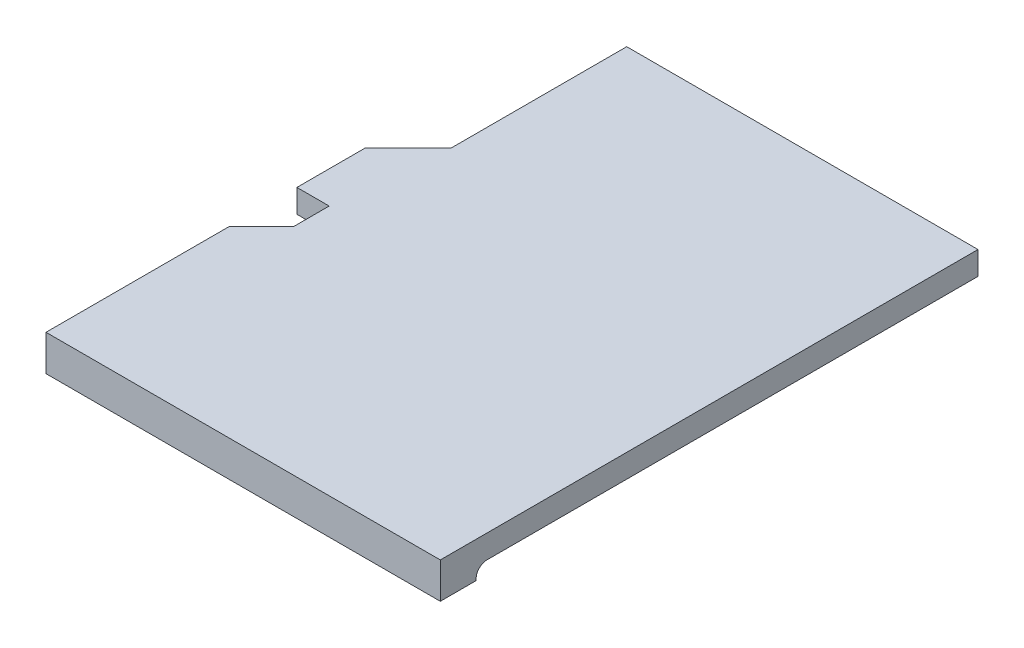
ISO-10303-21;
HEADER;
FILE_DESCRIPTION(('STEP AP214'),'2;1');
FILE_NAME('part.step','',(''),(''),'','','');
FILE_SCHEMA(('AUTOMOTIVE_DESIGN { 1 0 10303 214 1 1 1 1 }'));
ENDSEC;
DATA;
#1=APPLICATION_CONTEXT('core data for automotive mechanical design processes');
#2=APPLICATION_PROTOCOL_DEFINITION('international standard','automotive_design',2000,#1);
#3=PRODUCT_CONTEXT('',#1,'mechanical');
#4=PRODUCT('Part','Part','',(#3));
#5=PRODUCT_RELATED_PRODUCT_CATEGORY('part','',(#4));
#6=PRODUCT_DEFINITION_FORMATION('','',#4);
#7=PRODUCT_DEFINITION_CONTEXT('part definition',#1,'design');
#8=PRODUCT_DEFINITION('design','',#6,#7);
#9=PRODUCT_DEFINITION_SHAPE('','',#8);
#10=(LENGTH_UNIT() NAMED_UNIT(*) SI_UNIT(.MILLI.,.METRE.));
#11=(NAMED_UNIT(*) PLANE_ANGLE_UNIT() SI_UNIT($,.RADIAN.));
#12=(NAMED_UNIT(*) SI_UNIT($,.STERADIAN.) SOLID_ANGLE_UNIT());
#13=UNCERTAINTY_MEASURE_WITH_UNIT(LENGTH_MEASURE(1.E-05),#10,'distance_accuracy_value','');
#14=(GEOMETRIC_REPRESENTATION_CONTEXT(3) GLOBAL_UNCERTAINTY_ASSIGNED_CONTEXT((#13)) GLOBAL_UNIT_ASSIGNED_CONTEXT((#10,
#11,#12)) REPRESENTATION_CONTEXT('',''));
#15=CARTESIAN_POINT('',(0.,0.,0.));
#16=DIRECTION('',(0.,0.,1.));
#17=DIRECTION('',(1.,0.,0.));
#18=AXIS2_PLACEMENT_3D('',#15,#16,#17);
#19=CARTESIAN_POINT('',(0.,0.,36.5));
#20=DIRECTION('',(0.,-1.,0.));
#21=DIRECTION('',(0.,0.,-1.));
#22=AXIS2_PLACEMENT_3D('',#19,#20,#21);
#23=CYLINDRICAL_SURFACE('',#22,30.5);
#24=CARTESIAN_POINT('',(0.,-0.300000000000005,36.5));
#25=DIRECTION('',(0.,-1.,0.));
#26=DIRECTION('',(0.,0.,-1.));
#27=AXIS2_PLACEMENT_3D('',#24,#25,#26);
#28=CIRCLE('',#27,30.5);
#29=CARTESIAN_POINT('',(-5.5,-0.299999999999936,6.5000000000003));
#30=VERTEX_POINT('',#29);
#31=CARTESIAN_POINT('',(0.,-0.3,6.));
#32=VERTEX_POINT('',#31);
#33=EDGE_CURVE('E11',#30,#32,#28,.T.);
#34=ORIENTED_EDGE('',*,*,#33,.T.);
#35=DIRECTION('',(0.,-1.,0.));
#36=VECTOR('',#35,1.);
#37=CARTESIAN_POINT('',(0.,0.,6.));
#38=LINE('',#37,#36);
#39=CARTESIAN_POINT('',(0.,-0.35,6.));
#40=VERTEX_POINT('',#39);
#41=EDGE_CURVE('E28',#32,#40,#38,.T.);
#42=ORIENTED_EDGE('',*,*,#41,.T.);
#43=CARTESIAN_POINT('',(0.,-0.35,36.5));
#44=DIRECTION('',(0.,-1.,0.));
#45=DIRECTION('',(0.,0.,-1.));
#46=AXIS2_PLACEMENT_3D('',#43,#44,#45);
#47=CIRCLE('',#46,30.5);
#48=CARTESIAN_POINT('',(-5.5,-0.35,6.5));
#49=VERTEX_POINT('',#48);
#50=EDGE_CURVE('E298',#49,#40,#47,.T.);
#51=ORIENTED_EDGE('',*,*,#50,.F.);
#52=DIRECTION('',(0.,1.,0.));
#53=VECTOR('',#52,1.);
#54=CARTESIAN_POINT('',(-5.5,0.,6.5));
#55=LINE('',#54,#53);
#56=EDGE_CURVE('E202',#49,#30,#55,.T.);
#57=ORIENTED_EDGE('',*,*,#56,.T.);
#58=EDGE_LOOP('',(#34,#42,#51,#57));
#59=FACE_BOUND('',#58,.T.);
#60=ADVANCED_FACE('F17',(#59),#23,.T.);
#61=CARTESIAN_POINT('',(0.0936244587815549,0.65,0.17467868973583));
#62=DIRECTION('',(0.,1.,0.));
#63=DIRECTION('',(1.,0.,0.));
#64=AXIS2_PLACEMENT_3D('',#61,#62,#63);
#65=PLANE('',#64);
#66=DIRECTION('',(1.,0.,0.));
#67=VECTOR('',#66,1.);
#68=CARTESIAN_POINT('',(0.0936244587815549,0.65,0.5));
#69=LINE('',#68,#67);
#70=CARTESIAN_POINT('',(-5.5,0.65,0.5));
#71=VERTEX_POINT('',#70);
#72=CARTESIAN_POINT('',(-4.6,0.65,0.5));
#73=VERTEX_POINT('',#72);
#74=EDGE_CURVE('E200',#71,#73,#69,.T.);
#75=ORIENTED_EDGE('',*,*,#74,.T.);
#76=DIRECTION('',(0.,0.,1.));
#77=VECTOR('',#76,1.);
#78=CARTESIAN_POINT('',(-4.6,0.65,0.17467868973583));
#79=LINE('',#78,#77);
#80=CARTESIAN_POINT('',(-4.6,0.65,1.5));
#81=VERTEX_POINT('',#80);
#82=EDGE_CURVE('E203',#73,#81,#79,.T.);
#83=ORIENTED_EDGE('',*,*,#82,.T.);
#84=DIRECTION('',(-0.707106781186548,0.,0.707106781186548));
#85=VECTOR('',#84,1.);
#86=CARTESIAN_POINT('',(-4.6,0.65,1.5));
#87=LINE('',#86,#85);
#88=CARTESIAN_POINT('',(-5.5,0.65,2.4));
#89=VERTEX_POINT('',#88);
#90=EDGE_CURVE('E214',#81,#89,#87,.T.);
#91=ORIENTED_EDGE('',*,*,#90,.T.);
#92=DIRECTION('',(0.,0.,1.));
#93=VECTOR('',#92,1.);
#94=CARTESIAN_POINT('',(-5.5,0.65,0.17467868973583));
#95=LINE('',#94,#93);
#96=CARTESIAN_POINT('',(-5.5,0.65,7.5));
#97=VERTEX_POINT('',#96);
#98=EDGE_CURVE('E218',#89,#97,#95,.T.);
#99=ORIENTED_EDGE('',*,*,#98,.T.);
#100=DIRECTION('',(1.,0.,0.));
#101=VECTOR('',#100,1.);
#102=CARTESIAN_POINT('',(0.0936244587815549,0.65,7.5));
#103=LINE('',#102,#101);
#104=CARTESIAN_POINT('',(5.5,0.65,7.5));
#105=VERTEX_POINT('',#104);
#106=EDGE_CURVE('E293',#97,#105,#103,.T.);
#107=ORIENTED_EDGE('',*,*,#106,.T.);
#108=DIRECTION('',(0.,0.,-1.));
#109=VECTOR('',#108,1.);
#110=CARTESIAN_POINT('',(5.5,0.65,0.17467868973583));
#111=LINE('',#110,#109);
#112=CARTESIAN_POINT('',(5.5,0.65,-7.5));
#113=VERTEX_POINT('',#112);
#114=EDGE_CURVE('E290',#105,#113,#111,.T.);
#115=ORIENTED_EDGE('',*,*,#114,.T.);
#116=DIRECTION('',(-1.,0.,0.));
#117=VECTOR('',#116,1.);
#118=CARTESIAN_POINT('',(0.0936244587815549,0.65,-7.5));
#119=LINE('',#118,#117);
#120=CARTESIAN_POINT('',(-4.3,0.65,-7.5));
#121=VERTEX_POINT('',#120);
#122=EDGE_CURVE('E294',#113,#121,#119,.T.);
#123=ORIENTED_EDGE('',*,*,#122,.T.);
#124=DIRECTION('',(0.,0.,1.));
#125=VECTOR('',#124,1.);
#126=CARTESIAN_POINT('',(-4.3,0.65,0.17467868973583));
#127=LINE('',#126,#125);
#128=CARTESIAN_POINT('',(-4.3,0.65,-2.6));
#129=VERTEX_POINT('',#128);
#130=EDGE_CURVE('E198',#121,#129,#127,.T.);
#131=ORIENTED_EDGE('',*,*,#130,.T.);
#132=DIRECTION('',(-0.707106781186548,0.,0.707106781186548));
#133=VECTOR('',#132,1.);
#134=CARTESIAN_POINT('',(-4.3,0.65,-2.6));
#135=LINE('',#134,#133);
#136=CARTESIAN_POINT('',(-5.5,0.65,-1.4));
#137=VERTEX_POINT('',#136);
#138=EDGE_CURVE('E166',#129,#137,#135,.T.);
#139=ORIENTED_EDGE('',*,*,#138,.T.);
#140=DIRECTION('',(0.,0.,1.));
#141=VECTOR('',#140,1.);
#142=CARTESIAN_POINT('',(-5.5,0.65,0.17467868973583));
#143=LINE('',#142,#141);
#144=EDGE_CURVE('E135',#137,#71,#143,.T.);
#145=ORIENTED_EDGE('',*,*,#144,.T.);
#146=EDGE_LOOP('',(#75,#83,#91,#99,#107,#115,#123,#131,#139,#145));
#147=FACE_BOUND('',#146,.T.);
#148=ADVANCED_FACE('F318',(#147),#65,.T.);
#149=CARTESIAN_POINT('',(-4.6,0.,0.5));
#150=DIRECTION('',(-1.,0.,0.));
#151=DIRECTION('',(0.,0.,1.));
#152=AXIS2_PLACEMENT_3D('',#149,#150,#151);
#153=PLANE('',#152);
#154=DIRECTION('',(0.,0.,1.));
#155=VECTOR('',#154,1.);
#156=CARTESIAN_POINT('',(-4.6,0.,0.17467868973583));
#157=LINE('',#156,#155);
#158=CARTESIAN_POINT('',(-4.6,0.,0.5));
#159=VERTEX_POINT('',#158);
#160=CARTESIAN_POINT('',(-4.6,0.,1.5));
#161=VERTEX_POINT('',#160);
#162=EDGE_CURVE('E308',#159,#161,#157,.T.);
#163=ORIENTED_EDGE('',*,*,#162,.T.);
#164=DIRECTION('',(0.,1.,0.));
#165=VECTOR('',#164,1.);
#166=CARTESIAN_POINT('',(-4.6,0.,1.5));
#167=LINE('',#166,#165);
#168=EDGE_CURVE('E207',#161,#81,#167,.T.);
#169=ORIENTED_EDGE('',*,*,#168,.T.);
#170=ORIENTED_EDGE('',*,*,#82,.F.);
#171=DIRECTION('',(0.,-1.,0.));
#172=VECTOR('',#171,1.);
#173=CARTESIAN_POINT('',(-4.6,0.,0.5));
#174=LINE('',#173,#172);
#175=EDGE_CURVE('E204',#73,#159,#174,.T.);
#176=ORIENTED_EDGE('',*,*,#175,.T.);
#177=EDGE_LOOP('',(#163,#169,#170,#176));
#178=FACE_BOUND('',#177,.T.);
#179=ADVANCED_FACE('F406',(#178),#153,.T.);
#180=CARTESIAN_POINT('',(-5.5,0.,0.5));
#181=DIRECTION('',(0.,0.,1.));
#182=DIRECTION('',(1.,0.,0.));
#183=AXIS2_PLACEMENT_3D('',#180,#181,#182);
#184=PLANE('',#183);
#185=DIRECTION('',(1.,0.,0.));
#186=VECTOR('',#185,1.);
#187=CARTESIAN_POINT('',(0.0936244587815548,0.,0.5));
#188=LINE('',#187,#186);
#189=CARTESIAN_POINT('',(-5.5,0.,0.5));
#190=VERTEX_POINT('',#189);
#191=EDGE_CURVE('E208',#190,#159,#188,.T.);
#192=ORIENTED_EDGE('',*,*,#191,.T.);
#193=ORIENTED_EDGE('',*,*,#175,.F.);
#194=ORIENTED_EDGE('',*,*,#74,.F.);
#195=DIRECTION('',(0.,-1.,0.));
#196=VECTOR('',#195,1.);
#197=CARTESIAN_POINT('',(-5.5,0.,0.5));
#198=LINE('',#197,#196);
#199=EDGE_CURVE('E297',#71,#190,#198,.T.);
#200=ORIENTED_EDGE('',*,*,#199,.T.);
#201=EDGE_LOOP('',(#192,#193,#194,#200));
#202=FACE_BOUND('',#201,.T.);
#203=ADVANCED_FACE('F19',(#202),#184,.T.);
#204=CARTESIAN_POINT('',(-5.5,0.,-1.4));
#205=DIRECTION('',(-1.,0.,0.));
#206=DIRECTION('',(0.,0.,1.));
#207=AXIS2_PLACEMENT_3D('',#204,#205,#206);
#208=PLANE('',#207);
#209=DIRECTION('',(0.,0.,1.));
#210=VECTOR('',#209,1.);
#211=CARTESIAN_POINT('',(-5.5,0.,-1.4));
#212=LINE('',#211,#210);
#213=CARTESIAN_POINT('',(-5.5,0.,-1.4));
#214=VERTEX_POINT('',#213);
#215=EDGE_CURVE('E181',#214,#190,#212,.T.);
#216=ORIENTED_EDGE('',*,*,#215,.T.);
#217=ORIENTED_EDGE('',*,*,#199,.F.);
#218=ORIENTED_EDGE('',*,*,#144,.F.);
#219=DIRECTION('',(0.,-1.,0.));
#220=VECTOR('',#219,1.);
#221=CARTESIAN_POINT('',(-5.5,0.,-1.4));
#222=LINE('',#221,#220);
#223=EDGE_CURVE('E153',#137,#214,#222,.T.);
#224=ORIENTED_EDGE('',*,*,#223,.T.);
#225=EDGE_LOOP('',(#216,#217,#218,#224));
#226=FACE_BOUND('',#225,.T.);
#227=ADVANCED_FACE('F402',(#226),#208,.T.);
#228=CARTESIAN_POINT('',(-4.3,0.,-2.6));
#229=DIRECTION('',(-0.707106781186547,0.,-0.707106781186548));
#230=DIRECTION('',(-0.707106781186548,0.,0.707106781186547));
#231=AXIS2_PLACEMENT_3D('',#228,#229,#230);
#232=PLANE('',#231);
#233=DIRECTION('',(-0.707106781186548,0.,0.707106781186547));
#234=VECTOR('',#233,1.);
#235=CARTESIAN_POINT('',(-4.3,0.,-2.6));
#236=LINE('',#235,#234);
#237=CARTESIAN_POINT('',(-4.3,0.,-2.6));
#238=VERTEX_POINT('',#237);
#239=EDGE_CURVE('E165',#238,#214,#236,.T.);
#240=ORIENTED_EDGE('',*,*,#239,.T.);
#241=ORIENTED_EDGE('',*,*,#223,.F.);
#242=ORIENTED_EDGE('',*,*,#138,.F.);
#243=DIRECTION('',(0.,-1.,0.));
#244=VECTOR('',#243,1.);
#245=CARTESIAN_POINT('',(-4.3,0.,-2.6));
#246=LINE('',#245,#244);
#247=EDGE_CURVE('E162',#129,#238,#246,.T.);
#248=ORIENTED_EDGE('',*,*,#247,.T.);
#249=EDGE_LOOP('',(#240,#241,#242,#248));
#250=FACE_BOUND('',#249,.T.);
#251=ADVANCED_FACE('F164',(#250),#232,.T.);
#252=CARTESIAN_POINT('',(-4.3,0.,-7.5));
#253=DIRECTION('',(-1.,0.,0.));
#254=DIRECTION('',(0.,0.,1.));
#255=AXIS2_PLACEMENT_3D('',#252,#253,#254);
#256=PLANE('',#255);
#257=DIRECTION('',(0.,0.,1.));
#258=VECTOR('',#257,1.);
#259=CARTESIAN_POINT('',(-4.3,0.,-7.5));
#260=LINE('',#259,#258);
#261=CARTESIAN_POINT('',(-4.3,0.,-7.5));
#262=VERTEX_POINT('',#261);
#263=EDGE_CURVE('E172',#262,#238,#260,.T.);
#264=ORIENTED_EDGE('',*,*,#263,.T.);
#265=ORIENTED_EDGE('',*,*,#247,.F.);
#266=ORIENTED_EDGE('',*,*,#130,.F.);
#267=DIRECTION('',(0.,-1.,0.));
#268=VECTOR('',#267,1.);
#269=CARTESIAN_POINT('',(-4.3,0.,-7.5));
#270=LINE('',#269,#268);
#271=EDGE_CURVE('E186',#121,#262,#270,.T.);
#272=ORIENTED_EDGE('',*,*,#271,.T.);
#273=EDGE_LOOP('',(#264,#265,#266,#272));
#274=FACE_BOUND('',#273,.T.);
#275=ADVANCED_FACE('F184',(#274),#256,.T.);
#276=CARTESIAN_POINT('',(5.5,0.,-7.5));
#277=DIRECTION('',(0.,0.,-1.));
#278=DIRECTION('',(0.,-1.,0.));
#279=AXIS2_PLACEMENT_3D('',#276,#277,#278);
#280=PLANE('',#279);
#281=DIRECTION('',(-1.,0.,0.));
#282=VECTOR('',#281,1.);
#283=CARTESIAN_POINT('',(5.5,0.,-7.5));
#284=LINE('',#283,#282);
#285=CARTESIAN_POINT('',(5.5,0.,-7.5));
#286=VERTEX_POINT('',#285);
#287=EDGE_CURVE('E194',#286,#262,#284,.T.);
#288=ORIENTED_EDGE('',*,*,#287,.T.);
#289=ORIENTED_EDGE('',*,*,#271,.F.);
#290=ORIENTED_EDGE('',*,*,#122,.F.);
#291=DIRECTION('',(0.,-1.,0.));
#292=VECTOR('',#291,1.);
#293=CARTESIAN_POINT('',(5.5,0.,-7.5));
#294=LINE('',#293,#292);
#295=EDGE_CURVE('E209',#113,#286,#294,.T.);
#296=ORIENTED_EDGE('',*,*,#295,.T.);
#297=EDGE_LOOP('',(#288,#289,#290,#296));
#298=FACE_BOUND('',#297,.T.);
#299=ADVANCED_FACE('F239',(#298),#280,.T.);
#300=CARTESIAN_POINT('',(5.5,0.,7.5));
#301=DIRECTION('',(1.,0.,0.));
#302=DIRECTION('',(0.,1.,0.));
#303=AXIS2_PLACEMENT_3D('',#300,#301,#302);
#304=PLANE('',#303);
#305=DIRECTION('',(0.,-1.,0.));
#306=VECTOR('',#305,1.);
#307=CARTESIAN_POINT('',(5.5,0.,7.5));
#308=LINE('',#307,#306);
#309=CARTESIAN_POINT('',(5.5,-0.35,7.5));
#310=VERTEX_POINT('',#309);
#311=EDGE_CURVE('E213',#105,#310,#308,.T.);
#312=ORIENTED_EDGE('',*,*,#311,.T.);
#313=DIRECTION('',(0.,0.,1.));
#314=VECTOR('',#313,1.);
#315=CARTESIAN_POINT('',(5.5,-0.35,6.93372741582503));
#316=LINE('',#315,#314);
#317=CARTESIAN_POINT('',(5.5,-0.35,6.5));
#318=VERTEX_POINT('',#317);
#319=EDGE_CURVE('E350',#318,#310,#316,.T.);
#320=ORIENTED_EDGE('',*,*,#319,.F.);
#321=DIRECTION('',(0.,-1.,0.));
#322=VECTOR('',#321,1.);
#323=CARTESIAN_POINT('',(5.5,0.,6.5));
#324=LINE('',#323,#322);
#325=CARTESIAN_POINT('',(5.5,-0.3,6.5));
#326=VERTEX_POINT('',#325);
#327=EDGE_CURVE('E56',#326,#318,#324,.T.);
#328=ORIENTED_EDGE('',*,*,#327,.F.);
#329=CARTESIAN_POINT('',(5.5,-0.3,6.5));
#330=CARTESIAN_POINT('',(5.5,-0.24109021297151,6.5));
#331=CARTESIAN_POINT('',(5.5,-0.184236149757684,6.47608944724551));
#332=CARTESIAN_POINT('',(5.5,-0.129768721605437,6.45318261806537));
#333=CARTESIAN_POINT('',(5.5,-0.0870808577665255,6.40986875163291));
#334=CARTESIAN_POINT('',(5.5,-0.0464811982762055,6.36867371233548));
#335=CARTESIAN_POINT('',(5.5,-0.0228842850458032,6.31125118119008));
#336=CARTESIAN_POINT('',(5.5,0.,6.25556281390441));
#337=CARTESIAN_POINT('',(5.5,0.,6.19504990929699));
#338=B_SPLINE_CURVE_WITH_KNOTS('',2,(#329,#330,#331,#332,#333,#334,#335,#336,#337),
.UNSPECIFIED.,.F.,.F.,(3,2,2,2,3),(0.,0.25,0.5,0.75,1.),.UNSPECIFIED.);
#339=CARTESIAN_POINT('',(5.5,0.,6.19504990929699));
#340=VERTEX_POINT('',#339);
#341=EDGE_CURVE('E221',#326,#340,#338,.T.);
#342=ORIENTED_EDGE('',*,*,#341,.T.);
#343=DIRECTION('',(0.,0.,-1.));
#344=VECTOR('',#343,1.);
#345=CARTESIAN_POINT('',(5.5,0.,7.5));
#346=LINE('',#345,#344);
#347=EDGE_CURVE('E334',#340,#286,#346,.T.);
#348=ORIENTED_EDGE('',*,*,#347,.T.);
#349=ORIENTED_EDGE('',*,*,#295,.F.);
#350=ORIENTED_EDGE('',*,*,#114,.F.);
#351=EDGE_LOOP('',(#312,#320,#328,#342,#348,#349,#350));
#352=FACE_BOUND('',#351,.T.);
#353=ADVANCED_FACE('F228',(#352),#304,.T.);
#354=CARTESIAN_POINT('',(-5.5,0.,7.5));
#355=DIRECTION('',(0.,0.,1.));
#356=DIRECTION('',(1.,0.,0.));
#357=AXIS2_PLACEMENT_3D('',#354,#355,#356);
#358=PLANE('',#357);
#359=ORIENTED_EDGE('',*,*,#311,.F.);
#360=ORIENTED_EDGE('',*,*,#106,.F.);
#361=DIRECTION('',(0.,-1.,0.));
#362=VECTOR('',#361,1.);
#363=CARTESIAN_POINT('',(-5.5,0.,7.5));
#364=LINE('',#363,#362);
#365=CARTESIAN_POINT('',(-5.5,-0.35,7.5));
#366=VERTEX_POINT('',#365);
#367=EDGE_CURVE('E327',#97,#366,#364,.T.);
#368=ORIENTED_EDGE('',*,*,#367,.T.);
#369=DIRECTION('',(1.,0.,0.));
#370=VECTOR('',#369,1.);
#371=CARTESIAN_POINT('',(-5.5,-0.35,7.5));
#372=LINE('',#371,#370);
#373=EDGE_CURVE('E335',#366,#310,#372,.T.);
#374=ORIENTED_EDGE('',*,*,#373,.T.);
#375=EDGE_LOOP('',(#359,#360,#368,#374));
#376=FACE_BOUND('',#375,.T.);
#377=ADVANCED_FACE('F238',(#376),#358,.T.);
#378=CARTESIAN_POINT('',(-5.5,0.,2.4));
#379=DIRECTION('',(-1.,0.,0.));
#380=DIRECTION('',(0.,0.,1.));
#381=AXIS2_PLACEMENT_3D('',#378,#379,#380);
#382=PLANE('',#381);
#383=DIRECTION('',(0.,0.,1.));
#384=VECTOR('',#383,1.);
#385=CARTESIAN_POINT('',(-5.5,-0.35,2.4));
#386=LINE('',#385,#384);
#387=EDGE_CURVE('E330',#49,#366,#386,.T.);
#388=ORIENTED_EDGE('',*,*,#387,.T.);
#389=ORIENTED_EDGE('',*,*,#367,.F.);
#390=ORIENTED_EDGE('',*,*,#98,.F.);
#391=DIRECTION('',(0.,-1.,0.));
#392=VECTOR('',#391,1.);
#393=CARTESIAN_POINT('',(-5.5,0.,2.4));
#394=LINE('',#393,#392);
#395=CARTESIAN_POINT('',(-5.5,0.,2.4));
#396=VERTEX_POINT('',#395);
#397=EDGE_CURVE('E269',#89,#396,#394,.T.);
#398=ORIENTED_EDGE('',*,*,#397,.T.);
#399=DIRECTION('',(0.,0.,1.));
#400=VECTOR('',#399,1.);
#401=CARTESIAN_POINT('',(-5.5,0.,2.4));
#402=LINE('',#401,#400);
#403=CARTESIAN_POINT('',(-5.5,0.,6.19504990929698));
#404=VERTEX_POINT('',#403);
#405=EDGE_CURVE('E260',#396,#404,#402,.T.);
#406=ORIENTED_EDGE('',*,*,#405,.T.);
#407=CARTESIAN_POINT('',(-5.5,0.,6.19504990929698));
#408=CARTESIAN_POINT('',(-5.5,0.,6.25419985784716));
#409=CARTESIAN_POINT('',(-5.5,-0.0227962378481851,6.31113906109501));
#410=CARTESIAN_POINT('',(-5.5,-0.0448048092363428,6.36611087389195));
#411=CARTESIAN_POINT('',(-5.5,-0.0869303960203014,6.40971454586491));
#412=CARTESIAN_POINT('',(-5.5,-0.127341494740448,6.45154357252506));
#413=CARTESIAN_POINT('',(-5.5,-0.184164835495101,6.47605564080471));
#414=CARTESIAN_POINT('',(-5.5,-0.239672125463493,6.50000000000031));
#415=CARTESIAN_POINT('',(-5.5,-0.299999999999936,6.50000000000031));
#416=B_SPLINE_CURVE_WITH_KNOTS('',2,(#407,#408,#409,#410,#411,#412,#413,#414,#415),
.UNSPECIFIED.,.F.,.F.,(3,2,2,2,3),(0.,0.25,0.5,0.75,1.),.UNSPECIFIED.);
#417=EDGE_CURVE('E270',#404,#30,#416,.T.);
#418=ORIENTED_EDGE('',*,*,#417,.T.);
#419=ORIENTED_EDGE('',*,*,#56,.F.);
#420=EDGE_LOOP('',(#388,#389,#390,#398,#406,#418,#419));
#421=FACE_BOUND('',#420,.T.);
#422=ADVANCED_FACE('F328',(#421),#382,.T.);
#423=CARTESIAN_POINT('',(-4.6,0.,1.5));
#424=DIRECTION('',(-0.707106781186548,0.,-0.707106781186548));
#425=DIRECTION('',(-0.707106781186548,0.,0.707106781186548));
#426=AXIS2_PLACEMENT_3D('',#423,#424,#425);
#427=PLANE('',#426);
#428=DIRECTION('',(-0.707106781186548,0.,0.707106781186548));
#429=VECTOR('',#428,1.);
#430=CARTESIAN_POINT('',(-4.6,0.,1.5));
#431=LINE('',#430,#429);
#432=EDGE_CURVE('E301',#161,#396,#431,.T.);
#433=ORIENTED_EDGE('',*,*,#432,.T.);
#434=ORIENTED_EDGE('',*,*,#397,.F.);
#435=ORIENTED_EDGE('',*,*,#90,.F.);
#436=ORIENTED_EDGE('',*,*,#168,.F.);
#437=EDGE_LOOP('',(#433,#434,#435,#436));
#438=FACE_BOUND('',#437,.T.);
#439=ADVANCED_FACE('F240',(#438),#427,.T.);
#440=CARTESIAN_POINT('',(0.0936244587815548,0.,0.17467868973583));
#441=DIRECTION('',(0.,1.,0.));
#442=DIRECTION('',(1.,0.,0.));
#443=AXIS2_PLACEMENT_3D('',#440,#441,#442);
#444=PLANE('',#443);
#445=ORIENTED_EDGE('',*,*,#432,.F.);
#446=ORIENTED_EDGE('',*,*,#162,.F.);
#447=ORIENTED_EDGE('',*,*,#191,.F.);
#448=ORIENTED_EDGE('',*,*,#215,.F.);
#449=ORIENTED_EDGE('',*,*,#239,.F.);
#450=ORIENTED_EDGE('',*,*,#263,.F.);
#451=ORIENTED_EDGE('',*,*,#287,.F.);
#452=ORIENTED_EDGE('',*,*,#347,.F.);
#453=CARTESIAN_POINT('',(-5.5,0.,6.19504990929698));
#454=CARTESIAN_POINT('',(-4.59317757562048,0.,6.03047206577111));
#455=CARTESIAN_POINT('',(-3.6794285299481,3.15936940178445E-08,5.90659294085127));
#456=CARTESIAN_POINT('',(-2.30219940066824,-1.57734107000208E-07,5.78238427778572));
#457=CARTESIAN_POINT('',(-1.84224031739125,-1.8733366757949E-07,5.75135265479526));
#458=CARTESIAN_POINT('',(-1.15168534402053,-1.28183383127805E-07,5.7203989697491));
#459=CARTESIAN_POINT('',(-0.806253791237104,-7.77135606264603E-08,5.70882005924141));
#460=CARTESIAN_POINT('',(-0.403135620447256,-2.33459914379413E-08,5.70213543487449));
#461=CARTESIAN_POINT('',(-0.201567225778618,-6.35870334017389E-09,5.70049909124699));
#462=CARTESIAN_POINT('',(-0.100783121097509,-1.6569835842474E-09,5.70010739332633));
#463=CARTESIAN_POINT('',(-0.050391394393019,-4.22786890929074E-10,5.70001815921006));
#464=CARTESIAN_POINT('',(-0.0251956502567346,-1.06772759041445E-10,5.70000019532501));
#465=CARTESIAN_POINT('',(-0.012597812718328,-2.68287717637308E-11,5.69999787660325));
#466=CARTESIAN_POINT('',(-0.00719874739313918,-9.59669556661478E-12,5.69999831069033));
#467=CARTESIAN_POINT('',(-0.00359937232271826,-1.92675014372623E-12,5.69999891737524));
#468=CARTESIAN_POINT('',(-0.000204399906168787,0.,5.6999999295111));
#469=CARTESIAN_POINT('',(0.0261631879918559,0.,5.70000902257763));
#470=CARTESIAN_POINT('',(0.154561851046963,1.11038166298008E-09,5.69952504956788));
#471=CARTESIAN_POINT('',(0.500463384680978,-2.14211080142495E-09,5.70381225113656));
#472=CARTESIAN_POINT('',(0.641313731604549,-4.33046834984584E-09,5.70617230342131));
#473=CARTESIAN_POINT('',(0.890864025177906,-1.26528909096038E-08,5.71268615345355));
#474=CARTESIAN_POINT('',(0.980426072813249,-1.62847950180734E-08,5.71535902060874));
#475=CARTESIAN_POINT('',(1.12432435427219,-2.36022856330105E-08,5.72037135214053));
#476=CARTESIAN_POINT('',(1.19866221490277,-2.77301066045618E-08,5.72312883197029));
#477=CARTESIAN_POINT('',(1.28956620323545,-3.35119178511501E-08,5.72684638927006));
#478=CARTESIAN_POINT('',(1.33606176123916,-3.66637838158909E-08,5.72883831617622));
#479=CARTESIAN_POINT('',(1.35957035861573,-3.83074253406099E-08,5.72986858176061));
#480=CARTESIAN_POINT('',(1.36970135338482,-3.90266204223781E-08,5.73031758463297));
#481=CARTESIAN_POINT('',(1.37646776712267,-3.9509397665314E-08,5.73061859006381));
#482=CARTESIAN_POINT('',(1.38118603812681,-3.98482118486349E-08,5.73082948216625));
#483=CARTESIAN_POINT('',(1.64779912482642,-5.90626207330987E-08,5.74277807653688));
#484=CARTESIAN_POINT('',(1.894882004269,-7.96186503700981E-08,5.7572625226336));
#485=CARTESIAN_POINT('',(2.2393092618302,-1.01007544148707E-07,5.78104961228712));
#486=CARTESIAN_POINT('',(2.40497485574255,-1.09466245289336E-07,5.79346240445178));
#487=CARTESIAN_POINT('',(2.58680264014905,-1.14192991252872E-07,5.80848477050423));
#488=CARTESIAN_POINT('',(2.67485624378592,-1.15216178503362E-07,5.81608843436963));
#489=CARTESIAN_POINT('',(2.71198079376878,-1.15363988378557E-07,5.81936246626535));
#490=CARTESIAN_POINT('',(2.7365943610011,-1.15397805342236E-07,5.82154806740241));
#491=CARTESIAN_POINT('',(2.74665942995628,-1.15390879651952E-07,5.82244667607346));
#492=CARTESIAN_POINT('',(3.6790396898208,-1.11727280581612E-07,5.90636935393883));
#493=CARTESIAN_POINT('',(4.5932712990749,0.,6.03031501811935));
#494=CARTESIAN_POINT('',(5.5,0.,6.19504990929699));
#495=(BOUNDED_CURVE() B_SPLINE_CURVE(3,(#453,#454,#455,#456,#457,#458,#459,#460,#461,#462,#463,
#464,#465,#466,#467,#468,#469,#470,#471,#472,#473,#474,#475,#476,#477,#478,#479,#480,#481,#482,
#483,#484,#485,#486,#487,#488,#489,#490,#491,#492,#493,#494),.UNSPECIFIED.,.F.,
.F.) B_SPLINE_CURVE_WITH_KNOTS((4,2,2,1,1,1,1,1,1,1,2,2,2,2,2,1,1,1,1,2,2,2,1,1,1,2,2,4),(0.,
0.25,0.375,0.4375,0.46875,0.484375,0.4921875,0.49609375,0.498046875,0.4990234375,0.49951171875,
0.5,0.5625,0.59375,0.609375,0.6171875,0.62109375,0.623046875,0.6240234375,0.62451171875,0.625,
0.6875,0.71875,0.734375,0.7421875,0.746093749999999,0.75,1.),
.UNSPECIFIED.) CURVE() GEOMETRIC_REPRESENTATION_ITEM() RATIONAL_B_SPLINE_CURVE((1.,1.,1.,1.,1.,
1.,1.,1.,1.,1.,1.,1.,1.,1.,1.,1.,1.,1.,1.,1.,1.,1.,1.,1.,1.,1.,1.,1.,1.,1.,1.,1.,1.,1.,1.,1.,1.,
1.,1.,1.,1.,1.)) REPRESENTATION_ITEM(''));
#496=EDGE_CURVE('E361',#404,#340,#495,.T.);
#497=ORIENTED_EDGE('',*,*,#496,.F.);
#498=ORIENTED_EDGE('',*,*,#405,.F.);
#499=EDGE_LOOP('',(#445,#446,#447,#448,#449,#450,#451,#452,#497,#498));
#500=FACE_BOUND('',#499,.T.);
#501=ADVANCED_FACE('F177',(#500),#444,.F.);
#502=CARTESIAN_POINT('',(0.,-0.35,6.93372741582503));
#503=DIRECTION('',(0.,-1.,0.));
#504=DIRECTION('',(0.,0.,-1.));
#505=AXIS2_PLACEMENT_3D('',#502,#503,#504);
#506=PLANE('',#505);
#507=ORIENTED_EDGE('',*,*,#387,.F.);
#508=ORIENTED_EDGE('',*,*,#50,.T.);
#509=CARTESIAN_POINT('',(0.,-0.35,36.5));
#510=DIRECTION('',(0.,-1.,0.));
#511=DIRECTION('',(0.,0.,-1.));
#512=AXIS2_PLACEMENT_3D('',#509,#510,#511);
#513=CIRCLE('',#512,30.5);
#514=EDGE_CURVE('E302',#40,#318,#513,.T.);
#515=ORIENTED_EDGE('',*,*,#514,.T.);
#516=ORIENTED_EDGE('',*,*,#319,.T.);
#517=ORIENTED_EDGE('',*,*,#373,.F.);
#518=EDGE_LOOP('',(#507,#508,#515,#516,#517));
#519=FACE_BOUND('',#518,.T.);
#520=ADVANCED_FACE('F247',(#519),#506,.T.);
#521=CARTESIAN_POINT('',(0.,-0.300000000000007,36.5));
#522=DIRECTION('',(0.,1.,0.));
#523=DIRECTION('',(0.,0.,1.));
#524=AXIS2_PLACEMENT_3D('',#521,#522,#523);
#525=TOROIDAL_SURFACE('',#524,30.8,0.3);
#526=ORIENTED_EDGE('',*,*,#417,.F.);
#527=ORIENTED_EDGE('',*,*,#496,.T.);
#528=ORIENTED_EDGE('',*,*,#341,.F.);
#529=CARTESIAN_POINT('',(0.,-0.300000000000005,36.5));
#530=DIRECTION('',(0.,-1.,0.));
#531=DIRECTION('',(0.,0.,-1.));
#532=AXIS2_PLACEMENT_3D('',#529,#530,#531);
#533=CIRCLE('',#532,30.5);
#534=EDGE_CURVE('E368',#32,#326,#533,.T.);
#535=ORIENTED_EDGE('',*,*,#534,.F.);
#536=ORIENTED_EDGE('',*,*,#33,.F.);
#537=EDGE_LOOP('',(#526,#527,#528,#535,#536));
#538=FACE_BOUND('',#537,.T.);
#539=ADVANCED_FACE('F242',(#538),#525,.F.);
#540=CARTESIAN_POINT('',(0.,0.,36.5));
#541=DIRECTION('',(0.,-1.,0.));
#542=DIRECTION('',(0.,0.,-1.));
#543=AXIS2_PLACEMENT_3D('',#540,#541,#542);
#544=CYLINDRICAL_SURFACE('',#543,30.5);
#545=ORIENTED_EDGE('',*,*,#41,.F.);
#546=ORIENTED_EDGE('',*,*,#534,.T.);
#547=ORIENTED_EDGE('',*,*,#327,.T.);
#548=ORIENTED_EDGE('',*,*,#514,.F.);
#549=EDGE_LOOP('',(#545,#546,#547,#548));
#550=FACE_BOUND('',#549,.T.);
#551=ADVANCED_FACE('F246',(#550),#544,.T.);
#552=CLOSED_SHELL('',(#60,#148,#179,#203,#227,#251,#275,#299,#353,#377,#422,#439,#501,#520,#539,#551));
#553=MANIFOLD_SOLID_BREP('B1',#552);
#554=ADVANCED_BREP_SHAPE_REPRESENTATION('',(#18,#553),#14);
#555=SHAPE_DEFINITION_REPRESENTATION(#9,#554);
ENDSEC;
END-ISO-10303-21;
